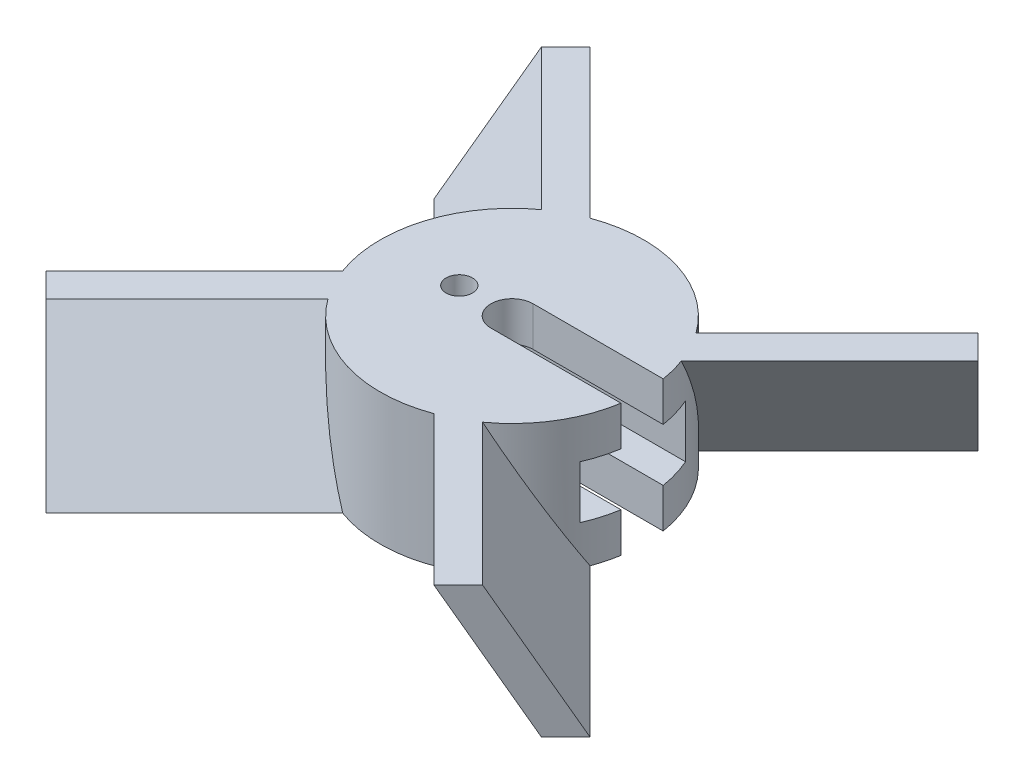
ISO-10303-21;
HEADER;
FILE_DESCRIPTION(('STEP AP214'),'2;1');
FILE_NAME('part.step','',(''),(''),'','','');
FILE_SCHEMA(('AUTOMOTIVE_DESIGN { 1 0 10303 214 1 1 1 1 }'));
ENDSEC;
DATA;
#1=APPLICATION_CONTEXT('core data for automotive mechanical design processes');
#2=APPLICATION_PROTOCOL_DEFINITION('international standard','automotive_design',2000,#1);
#3=PRODUCT_CONTEXT('',#1,'mechanical');
#4=PRODUCT('Part','Part','',(#3));
#5=PRODUCT_RELATED_PRODUCT_CATEGORY('part','',(#4));
#6=PRODUCT_DEFINITION_FORMATION('','',#4);
#7=PRODUCT_DEFINITION_CONTEXT('part definition',#1,'design');
#8=PRODUCT_DEFINITION('design','',#6,#7);
#9=PRODUCT_DEFINITION_SHAPE('','',#8);
#10=(LENGTH_UNIT() NAMED_UNIT(*) SI_UNIT(.MILLI.,.METRE.));
#11=(NAMED_UNIT(*) PLANE_ANGLE_UNIT() SI_UNIT($,.RADIAN.));
#12=(NAMED_UNIT(*) SI_UNIT($,.STERADIAN.) SOLID_ANGLE_UNIT());
#13=UNCERTAINTY_MEASURE_WITH_UNIT(LENGTH_MEASURE(1.E-05),#10,'distance_accuracy_value','');
#14=(GEOMETRIC_REPRESENTATION_CONTEXT(3) GLOBAL_UNCERTAINTY_ASSIGNED_CONTEXT((#13)) GLOBAL_UNIT_ASSIGNED_CONTEXT((#10,
#11,#12)) REPRESENTATION_CONTEXT('',''));
#15=CARTESIAN_POINT('',(0.,0.,0.));
#16=DIRECTION('',(0.,0.,1.));
#17=DIRECTION('',(1.,0.,0.));
#18=AXIS2_PLACEMENT_3D('',#15,#16,#17);
#19=CARTESIAN_POINT('',(0.,10.,0.));
#20=DIRECTION('',(0.,-1.,0.));
#21=DIRECTION('',(0.,0.,-1.));
#22=AXIS2_PLACEMENT_3D('',#19,#20,#21);
#23=CYLINDRICAL_SURFACE('',#22,10.);
#24=CARTESIAN_POINT('',(0.,2.74094045472347,0.));
#25=DIRECTION('',(-0.612372435695799,-0.500000000000006,-0.612372435695786));
#26=DIRECTION('',(0.353553390593282,-0.866025403784435,0.353553390593274));
#27=AXIS2_PLACEMENT_3D('',#24,#25,#26);
#28=ELLIPSE('',#27,19.9999999999998,10.);
#29=CARTESIAN_POINT('',(-9.38359800667765,10.,3.45660070720863));
#30=VERTEX_POINT('',#29);
#31=CARTESIAN_POINT('',(-5.86298353625583,0.,8.10095204612353));
#32=VERTEX_POINT('',#31);
#33=EDGE_CURVE('E56',#30,#32,#28,.F.);
#34=ORIENTED_EDGE('',*,*,#33,.F.);
#35=CARTESIAN_POINT('',(0.,10.,0.));
#36=DIRECTION('',(0.,1.,0.));
#37=DIRECTION('',(0.,0.,1.));
#38=AXIS2_PLACEMENT_3D('',#35,#36,#37);
#39=CIRCLE('',#38,10.);
#40=CARTESIAN_POINT('',(-5.86298353630549,10.,-8.1009520460876));
#41=VERTEX_POINT('',#40);
#42=EDGE_CURVE('E509',#41,#30,#39,.T.);
#43=ORIENTED_EDGE('',*,*,#42,.F.);
#44=CARTESIAN_POINT('',(0.,7.25905954528574,0.));
#45=DIRECTION('',(-0.612372435695792,0.500000000000006,0.612372435695792));
#46=DIRECTION('',(-0.353553390593278,-0.866025403784435,0.353553390593278));
#47=AXIS2_PLACEMENT_3D('',#44,#45,#46);
#48=ELLIPSE('',#47,19.9999999999998,10.);
#49=CARTESIAN_POINT('',(-9.3835980067638,0.,-3.45660070723852));
#50=VERTEX_POINT('',#49);
#51=EDGE_CURVE('E258',#50,#41,#48,.F.);
#52=ORIENTED_EDGE('',*,*,#51,.F.);
#53=CARTESIAN_POINT('',(0.,0.,0.));
#54=DIRECTION('',(0.,1.,0.));
#55=DIRECTION('',(0.,0.,1.));
#56=AXIS2_PLACEMENT_3D('',#53,#54,#55);
#57=CIRCLE('',#56,10.);
#58=EDGE_CURVE('E235',#50,#32,#57,.T.);
#59=ORIENTED_EDGE('',*,*,#58,.T.);
#60=EDGE_LOOP('',(#34,#43,#52,#59));
#61=FACE_BOUND('',#60,.T.);
#62=ADVANCED_FACE('F32',(#61),#23,.T.);
#63=CARTESIAN_POINT('',(0.,7.25905954528574,0.));
#64=DIRECTION('',(0.612372435695799,0.500000000000006,0.612372435695786));
#65=DIRECTION('',(0.353553390593282,-0.866025403784435,0.353553390593274));
#66=AXIS2_PLACEMENT_3D('',#63,#64,#65);
#67=ELLIPSE('',#66,19.9999999999998,10.);
#68=CARTESIAN_POINT('',(-3.45660070706799,0.,9.38359800659327));
#69=VERTEX_POINT('',#68);
#70=CARTESIAN_POINT('',(-8.10095204611743,10.,5.86298353626426));
#71=VERTEX_POINT('',#70);
#72=EDGE_CURVE('E240',#69,#71,#67,.F.);
#73=ORIENTED_EDGE('',*,*,#72,.F.);
#74=CARTESIAN_POINT('',(8.10095204608972,0.,5.86298353630255));
#75=VERTEX_POINT('',#74);
#76=EDGE_CURVE('E224',#69,#75,#57,.T.);
#77=ORIENTED_EDGE('',*,*,#76,.T.);
#78=CARTESIAN_POINT('',(0.,2.74094045472347,0.));
#79=DIRECTION('',(-0.612372435695792,-0.500000000000006,0.612372435695792));
#80=DIRECTION('',(0.353553390593278,-0.866025403784435,-0.353553390593278));
#81=AXIS2_PLACEMENT_3D('',#78,#79,#80);
#82=ELLIPSE('',#81,19.9999999999998,10.);
#83=CARTESIAN_POINT('',(3.45660070720854,10.,9.38359800667769));
#84=VERTEX_POINT('',#83);
#85=EDGE_CURVE('E315',#84,#75,#82,.F.);
#86=ORIENTED_EDGE('',*,*,#85,.F.);
#87=EDGE_CURVE('E48',#71,#84,#39,.T.);
#88=ORIENTED_EDGE('',*,*,#87,.F.);
#89=EDGE_LOOP('',(#73,#77,#86,#88));
#90=FACE_BOUND('',#89,.T.);
#91=ADVANCED_FACE('F241',(#90),#23,.T.);
#92=CARTESIAN_POINT('',(0.,2.74094045472347,0.));
#93=DIRECTION('',(0.612372435695792,-0.500000000000006,-0.612372435695792));
#94=DIRECTION('',(-0.353553390593278,-0.866025403784435,0.353553390593278));
#95=AXIS2_PLACEMENT_3D('',#92,#93,#94);
#96=ELLIPSE('',#95,19.9999999999998,10.);
#97=CARTESIAN_POINT('',(-3.45660070720854,10.,-9.38359800667769));
#98=VERTEX_POINT('',#97);
#99=CARTESIAN_POINT('',(-8.10095204608972,0.,-5.86298353630255));
#100=VERTEX_POINT('',#99);
#101=EDGE_CURVE('E261',#98,#100,#96,.F.);
#102=ORIENTED_EDGE('',*,*,#101,.F.);
#103=CARTESIAN_POINT('',(8.10095204612205,10.,-5.86298353625788));
#104=VERTEX_POINT('',#103);
#105=EDGE_CURVE('E414',#104,#98,#39,.T.);
#106=ORIENTED_EDGE('',*,*,#105,.F.);
#107=CARTESIAN_POINT('',(0.,7.25905954528574,0.));
#108=DIRECTION('',(-0.612372435695794,0.500000000000006,-0.61237243569579));
#109=DIRECTION('',(-0.353553390593279,-0.866025403784435,-0.353553390593277));
#110=AXIS2_PLACEMENT_3D('',#107,#108,#109);
#111=ELLIPSE('',#110,19.9999999999998,10.);
#112=CARTESIAN_POINT('',(3.45660070723852,0.,-9.3835980067638));
#113=VERTEX_POINT('',#112);
#114=EDGE_CURVE('E285',#113,#104,#111,.F.);
#115=ORIENTED_EDGE('',*,*,#114,.F.);
#116=EDGE_CURVE('E417',#113,#100,#57,.T.);
#117=ORIENTED_EDGE('',*,*,#116,.T.);
#118=EDGE_LOOP('',(#102,#106,#115,#117));
#119=FACE_BOUND('',#118,.T.);
#120=ADVANCED_FACE('F508',(#119),#23,.T.);
#121=CARTESIAN_POINT('',(0.,2.74094045472347,0.));
#122=DIRECTION('',(0.612372435695794,-0.500000000000006,0.61237243569579));
#123=DIRECTION('',(-0.353553390593279,-0.866025403784435,-0.353553390593277));
#124=AXIS2_PLACEMENT_3D('',#121,#122,#123);
#125=ELLIPSE('',#124,19.9999999999998,10.);
#126=CARTESIAN_POINT('',(9.38359800667768,10.,-3.45660070720857));
#127=VERTEX_POINT('',#126);
#128=CARTESIAN_POINT('',(5.86298353630252,0.,-8.10095204608974));
#129=VERTEX_POINT('',#128);
#130=EDGE_CURVE('E288',#127,#129,#125,.F.);
#131=ORIENTED_EDGE('',*,*,#130,.F.);
#132=CARTESIAN_POINT('',(9.87117014340245,10.,-1.6));
#133=VERTEX_POINT('',#132);
#134=EDGE_CURVE('E411',#133,#127,#39,.T.);
#135=ORIENTED_EDGE('',*,*,#134,.F.);
#136=DIRECTION('',(0.,-1.,0.));
#137=VECTOR('',#136,1.);
#138=CARTESIAN_POINT('',(9.87117014340245,10.,-1.6));
#139=LINE('',#138,#137);
#140=CARTESIAN_POINT('',(9.87117014340245,7.,-1.6));
#141=VERTEX_POINT('',#140);
#142=EDGE_CURVE('E399',#133,#141,#139,.T.);
#143=ORIENTED_EDGE('',*,*,#142,.T.);
#144=CARTESIAN_POINT('',(0.,7.,0.));
#145=DIRECTION('',(0.,1.,0.));
#146=DIRECTION('',(0.,0.,1.));
#147=AXIS2_PLACEMENT_3D('',#144,#145,#146);
#148=CIRCLE('',#147,10.);
#149=CARTESIAN_POINT('',(9.16515138991168,7.,-4.));
#150=VERTEX_POINT('',#149);
#151=EDGE_CURVE('E361',#141,#150,#148,.T.);
#152=ORIENTED_EDGE('',*,*,#151,.T.);
#153=DIRECTION('',(0.,-1.,0.));
#154=VECTOR('',#153,1.);
#155=CARTESIAN_POINT('',(9.16515138991168,10.,-4.));
#156=LINE('',#155,#154);
#157=CARTESIAN_POINT('',(9.16515138991168,3.,-4.));
#158=VERTEX_POINT('',#157);
#159=EDGE_CURVE('E424',#150,#158,#156,.T.);
#160=ORIENTED_EDGE('',*,*,#159,.T.);
#161=CARTESIAN_POINT('',(0.,3.,0.));
#162=DIRECTION('',(0.,-1.,0.));
#163=DIRECTION('',(0.,0.,-1.));
#164=AXIS2_PLACEMENT_3D('',#161,#162,#163);
#165=CIRCLE('',#164,10.);
#166=CARTESIAN_POINT('',(9.87117014340245,3.,-1.6));
#167=VERTEX_POINT('',#166);
#168=EDGE_CURVE('E348',#158,#167,#165,.T.);
#169=ORIENTED_EDGE('',*,*,#168,.T.);
#170=CARTESIAN_POINT('',(9.87117014340245,0.,-1.6));
#171=VERTEX_POINT('',#170);
#172=EDGE_CURVE('E390',#167,#171,#139,.T.);
#173=ORIENTED_EDGE('',*,*,#172,.T.);
#174=EDGE_CURVE('E238',#171,#129,#57,.T.);
#175=ORIENTED_EDGE('',*,*,#174,.T.);
#176=EDGE_LOOP('',(#131,#135,#143,#152,#160,#169,#173,#175));
#177=FACE_BOUND('',#176,.T.);
#178=ADVANCED_FACE('F478',(#177),#23,.T.);
#179=CARTESIAN_POINT('',(0.,7.25905954528574,0.));
#180=DIRECTION('',(0.612372435695792,0.500000000000006,-0.612372435695792));
#181=DIRECTION('',(0.353553390593278,-0.866025403784435,-0.353553390593278));
#182=AXIS2_PLACEMENT_3D('',#179,#180,#181);
#183=ELLIPSE('',#182,19.9999999999998,10.);
#184=CARTESIAN_POINT('',(9.3835980067638,0.,3.45660070723852));
#185=VERTEX_POINT('',#184);
#186=CARTESIAN_POINT('',(5.86298353627457,10.,8.10095204610997));
#187=VERTEX_POINT('',#186);
#188=EDGE_CURVE('E312',#185,#187,#183,.F.);
#189=ORIENTED_EDGE('',*,*,#188,.F.);
#190=CARTESIAN_POINT('',(9.87117014340245,0.,1.6));
#191=VERTEX_POINT('',#190);
#192=EDGE_CURVE('E236',#185,#191,#57,.T.);
#193=ORIENTED_EDGE('',*,*,#192,.T.);
#194=DIRECTION('',(0.,-1.,0.));
#195=VECTOR('',#194,1.);
#196=CARTESIAN_POINT('',(9.87117014340245,10.,1.6));
#197=LINE('',#196,#195);
#198=CARTESIAN_POINT('',(9.87117014340245,3.,1.6));
#199=VERTEX_POINT('',#198);
#200=EDGE_CURVE('E403',#191,#199,#197,.F.);
#201=ORIENTED_EDGE('',*,*,#200,.T.);
#202=CARTESIAN_POINT('',(9.16515138991168,3.,4.));
#203=VERTEX_POINT('',#202);
#204=EDGE_CURVE('E352',#199,#203,#165,.T.);
#205=ORIENTED_EDGE('',*,*,#204,.T.);
#206=DIRECTION('',(0.,-1.,0.));
#207=VECTOR('',#206,1.);
#208=CARTESIAN_POINT('',(9.16515138991168,10.,4.));
#209=LINE('',#208,#207);
#210=CARTESIAN_POINT('',(9.16515138991168,7.,4.));
#211=VERTEX_POINT('',#210);
#212=EDGE_CURVE('E413',#203,#211,#209,.F.);
#213=ORIENTED_EDGE('',*,*,#212,.T.);
#214=CARTESIAN_POINT('',(9.87117014340245,7.,1.6));
#215=VERTEX_POINT('',#214);
#216=EDGE_CURVE('E366',#211,#215,#148,.T.);
#217=ORIENTED_EDGE('',*,*,#216,.T.);
#218=CARTESIAN_POINT('',(9.87117014340245,10.,1.6));
#219=VERTEX_POINT('',#218);
#220=EDGE_CURVE('E402',#215,#219,#197,.F.);
#221=ORIENTED_EDGE('',*,*,#220,.T.);
#222=EDGE_CURVE('E415',#187,#219,#39,.T.);
#223=ORIENTED_EDGE('',*,*,#222,.F.);
#224=EDGE_LOOP('',(#189,#193,#201,#205,#213,#217,#221,#223));
#225=FACE_BOUND('',#224,.T.);
#226=ADVANCED_FACE('F462',(#225),#23,.T.);
#227=CARTESIAN_POINT('',(0.,0.,0.));
#228=DIRECTION('',(0.,1.,0.));
#229=DIRECTION('',(0.,0.,1.));
#230=AXIS2_PLACEMENT_3D('',#227,#228,#229);
#231=CYLINDRICAL_SURFACE('',#230,1.6);
#232=DIRECTION('',(0.,-1.,0.));
#233=VECTOR('',#232,1.);
#234=CARTESIAN_POINT('',(0.,0.,1.6));
#235=LINE('',#234,#233);
#236=CARTESIAN_POINT('',(0.,10.,1.6));
#237=VERTEX_POINT('',#236);
#238=CARTESIAN_POINT('',(0.,7.,1.6));
#239=VERTEX_POINT('',#238);
#240=EDGE_CURVE('E379',#237,#239,#235,.T.);
#241=ORIENTED_EDGE('',*,*,#240,.T.);
#242=CARTESIAN_POINT('',(0.,7.,0.));
#243=DIRECTION('',(0.,1.,0.));
#244=DIRECTION('',(0.,0.,1.));
#245=AXIS2_PLACEMENT_3D('',#242,#243,#244);
#246=CIRCLE('',#245,1.6);
#247=CARTESIAN_POINT('',(0.,7.,-1.6));
#248=VERTEX_POINT('',#247);
#249=EDGE_CURVE('E365',#239,#248,#246,.F.);
#250=ORIENTED_EDGE('',*,*,#249,.T.);
#251=DIRECTION('',(0.,1.,0.));
#252=VECTOR('',#251,1.);
#253=CARTESIAN_POINT('',(0.,0.,-1.6));
#254=LINE('',#253,#252);
#255=CARTESIAN_POINT('',(0.,10.,-1.6));
#256=VERTEX_POINT('',#255);
#257=EDGE_CURVE('E382',#248,#256,#254,.T.);
#258=ORIENTED_EDGE('',*,*,#257,.T.);
#259=CARTESIAN_POINT('',(0.,10.,0.));
#260=DIRECTION('',(0.,1.,0.));
#261=DIRECTION('',(0.,0.,1.));
#262=AXIS2_PLACEMENT_3D('',#259,#260,#261);
#263=CIRCLE('',#262,1.6);
#264=EDGE_CURVE('E406',#256,#237,#263,.T.);
#265=ORIENTED_EDGE('',*,*,#264,.T.);
#266=EDGE_LOOP('',(#241,#250,#258,#265));
#267=FACE_BOUND('',#266,.T.);
#268=ADVANCED_FACE('F527',(#267),#231,.F.);
#269=CARTESIAN_POINT('',(0.,0.,1.6));
#270=DIRECTION('',(0.,0.,1.));
#271=DIRECTION('',(1.,0.,0.));
#272=AXIS2_PLACEMENT_3D('',#269,#270,#271);
#273=PLANE('',#272);
#274=ORIENTED_EDGE('',*,*,#220,.F.);
#275=DIRECTION('',(-1.,0.,0.));
#276=VECTOR('',#275,1.);
#277=CARTESIAN_POINT('',(0.,7.,1.6));
#278=LINE('',#277,#276);
#279=EDGE_CURVE('E369',#215,#239,#278,.T.);
#280=ORIENTED_EDGE('',*,*,#279,.T.);
#281=ORIENTED_EDGE('',*,*,#240,.F.);
#282=DIRECTION('',(1.,0.,0.));
#283=VECTOR('',#282,1.);
#284=CARTESIAN_POINT('',(0.,10.,1.6));
#285=LINE('',#284,#283);
#286=EDGE_CURVE('E387',#237,#219,#285,.T.);
#287=ORIENTED_EDGE('',*,*,#286,.T.);
#288=EDGE_LOOP('',(#274,#280,#281,#287));
#289=FACE_BOUND('',#288,.T.);
#290=ADVANCED_FACE('F525',(#289),#273,.F.);
#291=CARTESIAN_POINT('',(0.,0.,-1.6));
#292=DIRECTION('',(0.,0.,-1.));
#293=DIRECTION('',(-1.,0.,0.));
#294=AXIS2_PLACEMENT_3D('',#291,#292,#293);
#295=PLANE('',#294);
#296=ORIENTED_EDGE('',*,*,#257,.F.);
#297=DIRECTION('',(1.,0.,0.));
#298=VECTOR('',#297,1.);
#299=CARTESIAN_POINT('',(0.,7.,-1.6));
#300=LINE('',#299,#298);
#301=EDGE_CURVE('E358',#248,#141,#300,.T.);
#302=ORIENTED_EDGE('',*,*,#301,.T.);
#303=ORIENTED_EDGE('',*,*,#142,.F.);
#304=DIRECTION('',(1.,0.,0.));
#305=VECTOR('',#304,1.);
#306=CARTESIAN_POINT('',(0.,10.,-1.6));
#307=LINE('',#306,#305);
#308=EDGE_CURVE('E391',#256,#133,#307,.T.);
#309=ORIENTED_EDGE('',*,*,#308,.F.);
#310=EDGE_LOOP('',(#296,#302,#303,#309));
#311=FACE_BOUND('',#310,.T.);
#312=ADVANCED_FACE('F484',(#311),#295,.F.);
#313=CARTESIAN_POINT('',(-4.,0.,0.));
#314=DIRECTION('',(0.,1.,0.));
#315=DIRECTION('',(0.,0.,1.));
#316=AXIS2_PLACEMENT_3D('',#313,#314,#315);
#317=CYLINDRICAL_SURFACE('',#316,1.);
#318=CARTESIAN_POINT('',(-4.,7.,0.));
#319=DIRECTION('',(0.,1.,0.));
#320=DIRECTION('',(0.,0.,1.));
#321=AXIS2_PLACEMENT_3D('',#318,#319,#320);
#322=CIRCLE('',#321,1.);
#323=CARTESIAN_POINT('',(-4.,7.,1.));
#324=VERTEX_POINT('',#323);
#325=EDGE_CURVE('E362',#324,#324,#322,.F.);
#326=ORIENTED_EDGE('',*,*,#325,.T.);
#327=EDGE_LOOP('',(#326));
#328=FACE_BOUND('',#327,.T.);
#329=CARTESIAN_POINT('',(-4.,10.,0.));
#330=DIRECTION('',(0.,1.,0.));
#331=DIRECTION('',(0.,0.,1.));
#332=AXIS2_PLACEMENT_3D('',#329,#330,#331);
#333=CIRCLE('',#332,1.);
#334=CARTESIAN_POINT('',(-4.,10.,1.));
#335=VERTEX_POINT('',#334);
#336=EDGE_CURVE('E376',#335,#335,#333,.T.);
#337=ORIENTED_EDGE('',*,*,#336,.T.);
#338=EDGE_LOOP('',(#337));
#339=FACE_BOUND('',#338,.T.);
#340=ADVANCED_FACE('F538',(#328,#339),#317,.F.);
#341=CARTESIAN_POINT('',(0.,0.,-1.6));
#342=VERTEX_POINT('',#341);
#343=CARTESIAN_POINT('',(0.,3.,-1.6));
#344=VERTEX_POINT('',#343);
#345=EDGE_CURVE('E383',#342,#344,#254,.T.);
#346=ORIENTED_EDGE('',*,*,#345,.T.);
#347=CARTESIAN_POINT('',(0.,3.,0.));
#348=DIRECTION('',(0.,-1.,0.));
#349=DIRECTION('',(0.,0.,-1.));
#350=AXIS2_PLACEMENT_3D('',#347,#348,#349);
#351=CIRCLE('',#350,1.6);
#352=CARTESIAN_POINT('',(0.,3.,1.6));
#353=VERTEX_POINT('',#352);
#354=EDGE_CURVE('E351',#344,#353,#351,.F.);
#355=ORIENTED_EDGE('',*,*,#354,.T.);
#356=CARTESIAN_POINT('',(0.,0.,1.6));
#357=VERTEX_POINT('',#356);
#358=EDGE_CURVE('E375',#353,#357,#235,.T.);
#359=ORIENTED_EDGE('',*,*,#358,.T.);
#360=CARTESIAN_POINT('',(0.,0.,0.));
#361=DIRECTION('',(0.,1.,0.));
#362=DIRECTION('',(0.,0.,1.));
#363=AXIS2_PLACEMENT_3D('',#360,#361,#362);
#364=CIRCLE('',#363,1.6);
#365=EDGE_CURVE('E407',#342,#357,#364,.T.);
#366=ORIENTED_EDGE('',*,*,#365,.F.);
#367=EDGE_LOOP('',(#346,#355,#359,#366));
#368=FACE_BOUND('',#367,.T.);
#369=ADVANCED_FACE('F470',(#368),#231,.F.);
#370=CARTESIAN_POINT('',(0.,10.,0.));
#371=DIRECTION('',(0.,1.,0.));
#372=DIRECTION('',(0.,0.,1.));
#373=AXIS2_PLACEMENT_3D('',#370,#371,#372);
#374=PLANE('',#373);
#375=ORIENTED_EDGE('',*,*,#336,.F.);
#376=EDGE_LOOP('',(#375));
#377=FACE_BOUND('',#376,.T.);
#378=ORIENTED_EDGE('',*,*,#286,.F.);
#379=ORIENTED_EDGE('',*,*,#264,.F.);
#380=ORIENTED_EDGE('',*,*,#308,.T.);
#381=ORIENTED_EDGE('',*,*,#134,.T.);
#382=DIRECTION('',(-0.707106781186545,0.,0.70710678118655));
#383=VECTOR('',#382,1.);
#384=CARTESIAN_POINT('',(20.6411681794246,9.99999999999999,-14.7141708799028));
#385=LINE('',#384,#383);
#386=CARTESIAN_POINT('',(20.6411681794246,9.99999999999999,-14.7141708799028));
#387=VERTEX_POINT('',#386);
#388=EDGE_CURVE('E309',#387,#127,#385,.T.);
#389=ORIENTED_EDGE('',*,*,#388,.F.);
#390=DIRECTION('',(0.70710678118655,0.,0.707106781186545));
#391=VECTOR('',#390,1.);
#392=CARTESIAN_POINT('',(20.6411681794246,9.99999999999999,-14.7141708799028));
#393=LINE('',#392,#391);
#394=CARTESIAN_POINT('',(18.7966537845414,9.99999999999999,-16.558685274786));
#395=VERTEX_POINT('',#394);
#396=EDGE_CURVE('E291',#395,#387,#393,.T.);
#397=ORIENTED_EDGE('',*,*,#396,.F.);
#398=DIRECTION('',(-0.707106781186545,0.,0.70710678118655));
#399=VECTOR('',#398,1.);
#400=CARTESIAN_POINT('',(18.7966537845414,9.99999999999999,-16.558685274786));
#401=LINE('',#400,#399);
#402=EDGE_CURVE('E300',#395,#104,#401,.T.);
#403=ORIENTED_EDGE('',*,*,#402,.T.);
#404=ORIENTED_EDGE('',*,*,#105,.T.);
#405=DIRECTION('',(0.707106781186547,0.,0.707106781186547));
#406=VECTOR('',#405,1.);
#407=CARTESIAN_POINT('',(-14.7141708799027,9.99999999999999,-20.6411681794246));
#408=LINE('',#407,#406);
#409=CARTESIAN_POINT('',(-14.7141708799027,9.99999999999999,-20.6411681794246));
#410=VERTEX_POINT('',#409);
#411=EDGE_CURVE('E282',#410,#98,#408,.T.);
#412=ORIENTED_EDGE('',*,*,#411,.F.);
#413=DIRECTION('',(0.707106781186548,0.,-0.707106781186548));
#414=VECTOR('',#413,1.);
#415=CARTESIAN_POINT('',(-14.7141708799027,9.99999999999999,-20.6411681794246));
#416=LINE('',#415,#414);
#417=CARTESIAN_POINT('',(-16.558685274786,9.99999999999999,-18.7966537845414));
#418=VERTEX_POINT('',#417);
#419=EDGE_CURVE('E264',#418,#410,#416,.T.);
#420=ORIENTED_EDGE('',*,*,#419,.F.);
#421=DIRECTION('',(0.707106781186547,0.,0.707106781186547));
#422=VECTOR('',#421,1.);
#423=CARTESIAN_POINT('',(-16.558685274786,9.99999999999999,-18.7966537845414));
#424=LINE('',#423,#422);
#425=EDGE_CURVE('E273',#418,#41,#424,.T.);
#426=ORIENTED_EDGE('',*,*,#425,.T.);
#427=ORIENTED_EDGE('',*,*,#42,.T.);
#428=DIRECTION('',(0.70710678118654,0.,-0.707106781186555));
#429=VECTOR('',#428,1.);
#430=CARTESIAN_POINT('',(-20.6411681794245,9.99999999999999,14.714170879903));
#431=LINE('',#430,#429);
#432=CARTESIAN_POINT('',(-20.6411681794245,9.99999999999999,14.714170879903));
#433=VERTEX_POINT('',#432);
#434=EDGE_CURVE('E251',#433,#30,#431,.T.);
#435=ORIENTED_EDGE('',*,*,#434,.F.);
#436=DIRECTION('',(-0.707106781186555,0.,-0.70710678118654));
#437=VECTOR('',#436,1.);
#438=CARTESIAN_POINT('',(-20.6411681794245,9.99999999999999,14.714170879903));
#439=LINE('',#438,#437);
#440=CARTESIAN_POINT('',(-18.7966537845413,9.99999999999999,16.5586852747862));
#441=VERTEX_POINT('',#440);
#442=EDGE_CURVE('E734',#441,#433,#439,.T.);
#443=ORIENTED_EDGE('',*,*,#442,.F.);
#444=DIRECTION('',(0.70710678118654,0.,-0.707106781186555));
#445=VECTOR('',#444,1.);
#446=CARTESIAN_POINT('',(-18.7966537845413,9.99999999999999,16.5586852747862));
#447=LINE('',#446,#445);
#448=EDGE_CURVE('E248',#441,#71,#447,.T.);
#449=ORIENTED_EDGE('',*,*,#448,.T.);
#450=ORIENTED_EDGE('',*,*,#87,.T.);
#451=DIRECTION('',(-0.707106781186547,0.,-0.707106781186547));
#452=VECTOR('',#451,1.);
#453=CARTESIAN_POINT('',(14.7141708799027,9.99999999999999,20.6411681794246));
#454=LINE('',#453,#452);
#455=CARTESIAN_POINT('',(14.7141708799027,9.99999999999999,20.6411681794246));
#456=VERTEX_POINT('',#455);
#457=EDGE_CURVE('E333',#456,#84,#454,.T.);
#458=ORIENTED_EDGE('',*,*,#457,.F.);
#459=DIRECTION('',(-0.707106781186548,0.,0.707106781186548));
#460=VECTOR('',#459,1.);
#461=CARTESIAN_POINT('',(14.7141708799027,9.99999999999999,20.6411681794246));
#462=LINE('',#461,#460);
#463=CARTESIAN_POINT('',(16.558685274786,9.99999999999999,18.7966537845414));
#464=VERTEX_POINT('',#463);
#465=EDGE_CURVE('E317',#464,#456,#462,.T.);
#466=ORIENTED_EDGE('',*,*,#465,.F.);
#467=DIRECTION('',(-0.707106781186547,0.,-0.707106781186547));
#468=VECTOR('',#467,1.);
#469=CARTESIAN_POINT('',(16.558685274786,9.99999999999999,18.7966537845414));
#470=LINE('',#469,#468);
#471=EDGE_CURVE('E326',#464,#187,#470,.T.);
#472=ORIENTED_EDGE('',*,*,#471,.T.);
#473=ORIENTED_EDGE('',*,*,#222,.T.);
#474=EDGE_LOOP('',(#378,#379,#380,#381,#389,#397,#403,#404,#412,#420,#426,#427,#435,#443,#449,
#450,#458,#466,#472,#473));
#475=FACE_BOUND('',#474,.T.);
#476=ADVANCED_FACE('F490',(#377,#475),#374,.T.);
#477=CARTESIAN_POINT('',(0.,0.,0.));
#478=DIRECTION('',(0.,1.,0.));
#479=DIRECTION('',(0.,0.,1.));
#480=AXIS2_PLACEMENT_3D('',#477,#478,#479);
#481=PLANE('',#480);
#482=CARTESIAN_POINT('',(-4.,0.,0.));
#483=DIRECTION('',(0.,1.,0.));
#484=DIRECTION('',(0.,0.,1.));
#485=AXIS2_PLACEMENT_3D('',#482,#483,#484);
#486=CIRCLE('',#485,1.);
#487=CARTESIAN_POINT('',(-4.,0.,1.));
#488=VERTEX_POINT('',#487);
#489=EDGE_CURVE('E372',#488,#488,#486,.T.);
#490=ORIENTED_EDGE('',*,*,#489,.T.);
#491=EDGE_LOOP('',(#490));
#492=FACE_BOUND('',#491,.T.);
#493=ORIENTED_EDGE('',*,*,#365,.T.);
#494=DIRECTION('',(1.,0.,0.));
#495=VECTOR('',#494,1.);
#496=CARTESIAN_POINT('',(0.,0.,1.6));
#497=LINE('',#496,#495);
#498=EDGE_CURVE('E386',#357,#191,#497,.T.);
#499=ORIENTED_EDGE('',*,*,#498,.T.);
#500=ORIENTED_EDGE('',*,*,#192,.F.);
#501=DIRECTION('',(-0.707106781186547,0.,-0.707106781186547));
#502=VECTOR('',#501,1.);
#503=CARTESIAN_POINT('',(20.6411681794246,0.,14.7141708799027));
#504=LINE('',#503,#502);
#505=CARTESIAN_POINT('',(20.6411681794246,0.,14.7141708799027));
#506=VERTEX_POINT('',#505);
#507=EDGE_CURVE('E329',#506,#185,#504,.T.);
#508=ORIENTED_EDGE('',*,*,#507,.F.);
#509=DIRECTION('',(0.707106781186547,0.,-0.707106781186548));
#510=VECTOR('',#509,1.);
#511=CARTESIAN_POINT('',(20.6411681794246,0.,14.7141708799027));
#512=LINE('',#511,#510);
#513=CARTESIAN_POINT('',(18.7966537845414,0.,16.5586852747859));
#514=VERTEX_POINT('',#513);
#515=EDGE_CURVE('E322',#514,#506,#512,.T.);
#516=ORIENTED_EDGE('',*,*,#515,.F.);
#517=DIRECTION('',(-0.707106781186547,0.,-0.707106781186547));
#518=VECTOR('',#517,1.);
#519=CARTESIAN_POINT('',(18.7966537845414,0.,16.5586852747859));
#520=LINE('',#519,#518);
#521=EDGE_CURVE('E233',#514,#75,#520,.T.);
#522=ORIENTED_EDGE('',*,*,#521,.T.);
#523=ORIENTED_EDGE('',*,*,#76,.F.);
#524=DIRECTION('',(0.70710678118654,0.,-0.707106781186555));
#525=VECTOR('',#524,1.);
#526=CARTESIAN_POINT('',(-14.7141708799025,0.,20.6411681794248));
#527=LINE('',#526,#525);
#528=CARTESIAN_POINT('',(-14.7141708799025,0.,20.6411681794248));
#529=VERTEX_POINT('',#528);
#530=EDGE_CURVE('E229',#529,#69,#527,.T.);
#531=ORIENTED_EDGE('',*,*,#530,.F.);
#532=DIRECTION('',(0.707106781186555,0.,0.70710678118654));
#533=VECTOR('',#532,1.);
#534=CARTESIAN_POINT('',(-14.7141708799025,0.,20.6411681794248));
#535=LINE('',#534,#533);
#536=CARTESIAN_POINT('',(-16.5586852747857,0.,18.7966537845416));
#537=VERTEX_POINT('',#536);
#538=EDGE_CURVE('E739',#537,#529,#535,.T.);
#539=ORIENTED_EDGE('',*,*,#538,.F.);
#540=DIRECTION('',(0.70710678118654,0.,-0.707106781186555));
#541=VECTOR('',#540,1.);
#542=CARTESIAN_POINT('',(-16.5586852747857,0.,18.7966537845416));
#543=LINE('',#542,#541);
#544=EDGE_CURVE('E247',#537,#32,#543,.T.);
#545=ORIENTED_EDGE('',*,*,#544,.T.);
#546=ORIENTED_EDGE('',*,*,#58,.F.);
#547=DIRECTION('',(0.707106781186547,0.,0.707106781186547));
#548=VECTOR('',#547,1.);
#549=CARTESIAN_POINT('',(-20.6411681794246,0.,-14.7141708799027));
#550=LINE('',#549,#548);
#551=CARTESIAN_POINT('',(-20.6411681794246,0.,-14.7141708799027));
#552=VERTEX_POINT('',#551);
#553=EDGE_CURVE('E276',#552,#50,#550,.T.);
#554=ORIENTED_EDGE('',*,*,#553,.F.);
#555=DIRECTION('',(-0.707106781186547,0.,0.707106781186548));
#556=VECTOR('',#555,1.);
#557=CARTESIAN_POINT('',(-20.6411681794246,0.,-14.7141708799027));
#558=LINE('',#557,#556);
#559=CARTESIAN_POINT('',(-18.7966537845414,0.,-16.5586852747859));
#560=VERTEX_POINT('',#559);
#561=EDGE_CURVE('E269',#560,#552,#558,.T.);
#562=ORIENTED_EDGE('',*,*,#561,.F.);
#563=DIRECTION('',(0.707106781186547,0.,0.707106781186547));
#564=VECTOR('',#563,1.);
#565=CARTESIAN_POINT('',(-18.7966537845414,0.,-16.5586852747859));
#566=LINE('',#565,#564);
#567=EDGE_CURVE('E279',#560,#100,#566,.T.);
#568=ORIENTED_EDGE('',*,*,#567,.T.);
#569=ORIENTED_EDGE('',*,*,#116,.F.);
#570=DIRECTION('',(-0.707106781186545,0.,0.70710678118655));
#571=VECTOR('',#570,1.);
#572=CARTESIAN_POINT('',(14.7141708799027,0.,-20.6411681794247));
#573=LINE('',#572,#571);
#574=CARTESIAN_POINT('',(14.7141708799027,0.,-20.6411681794247));
#575=VERTEX_POINT('',#574);
#576=EDGE_CURVE('E303',#575,#113,#573,.T.);
#577=ORIENTED_EDGE('',*,*,#576,.F.);
#578=DIRECTION('',(-0.70710678118655,0.,-0.707106781186545));
#579=VECTOR('',#578,1.);
#580=CARTESIAN_POINT('',(14.7141708799027,0.,-20.6411681794247));
#581=LINE('',#580,#579);
#582=CARTESIAN_POINT('',(16.5586852747859,0.,-18.7966537845415));
#583=VERTEX_POINT('',#582);
#584=EDGE_CURVE('E296',#583,#575,#581,.T.);
#585=ORIENTED_EDGE('',*,*,#584,.F.);
#586=DIRECTION('',(-0.707106781186545,0.,0.70710678118655));
#587=VECTOR('',#586,1.);
#588=CARTESIAN_POINT('',(16.5586852747859,0.,-18.7966537845415));
#589=LINE('',#588,#587);
#590=EDGE_CURVE('E306',#583,#129,#589,.T.);
#591=ORIENTED_EDGE('',*,*,#590,.T.);
#592=ORIENTED_EDGE('',*,*,#174,.F.);
#593=DIRECTION('',(1.,0.,0.));
#594=VECTOR('',#593,1.);
#595=CARTESIAN_POINT('',(0.,0.,-1.6));
#596=LINE('',#595,#594);
#597=EDGE_CURVE('E394',#342,#171,#596,.T.);
#598=ORIENTED_EDGE('',*,*,#597,.F.);
#599=EDGE_LOOP('',(#493,#499,#500,#508,#516,#522,#523,#531,#539,#545,#546,#554,#562,#568,#569,
#577,#585,#591,#592,#598));
#600=FACE_BOUND('',#599,.T.);
#601=ADVANCED_FACE('F226',(#492,#600),#481,.F.);
#602=ORIENTED_EDGE('',*,*,#358,.F.);
#603=DIRECTION('',(1.,0.,0.));
#604=VECTOR('',#603,1.);
#605=CARTESIAN_POINT('',(0.,3.,1.6));
#606=LINE('',#605,#604);
#607=EDGE_CURVE('E355',#353,#199,#606,.T.);
#608=ORIENTED_EDGE('',*,*,#607,.T.);
#609=ORIENTED_EDGE('',*,*,#200,.F.);
#610=ORIENTED_EDGE('',*,*,#498,.F.);
#611=EDGE_LOOP('',(#602,#608,#609,#610));
#612=FACE_BOUND('',#611,.T.);
#613=ADVANCED_FACE('F466',(#612),#273,.F.);
#614=ORIENTED_EDGE('',*,*,#172,.F.);
#615=DIRECTION('',(-1.,0.,0.));
#616=VECTOR('',#615,1.);
#617=CARTESIAN_POINT('',(0.,3.,-1.6));
#618=LINE('',#617,#616);
#619=EDGE_CURVE('E345',#167,#344,#618,.T.);
#620=ORIENTED_EDGE('',*,*,#619,.T.);
#621=ORIENTED_EDGE('',*,*,#345,.F.);
#622=ORIENTED_EDGE('',*,*,#597,.T.);
#623=EDGE_LOOP('',(#614,#620,#621,#622));
#624=FACE_BOUND('',#623,.T.);
#625=ADVANCED_FACE('F474',(#624),#295,.F.);
#626=CARTESIAN_POINT('',(-4.,3.,0.));
#627=DIRECTION('',(0.,-1.,0.));
#628=DIRECTION('',(0.,0.,-1.));
#629=AXIS2_PLACEMENT_3D('',#626,#627,#628);
#630=CIRCLE('',#629,1.);
#631=CARTESIAN_POINT('',(-4.,3.,-1.));
#632=VERTEX_POINT('',#631);
#633=EDGE_CURVE('E338',#632,#632,#630,.F.);
#634=ORIENTED_EDGE('',*,*,#633,.T.);
#635=EDGE_LOOP('',(#634));
#636=FACE_BOUND('',#635,.T.);
#637=ORIENTED_EDGE('',*,*,#489,.F.);
#638=EDGE_LOOP('',(#637));
#639=FACE_BOUND('',#638,.T.);
#640=ADVANCED_FACE('F642',(#636,#639),#317,.F.);
#641=CARTESIAN_POINT('',(-7.,3.,4.));
#642=DIRECTION('',(0.,0.,1.));
#643=DIRECTION('',(1.,0.,0.));
#644=AXIS2_PLACEMENT_3D('',#641,#642,#643);
#645=PLANE('',#644);
#646=DIRECTION('',(1.,0.,0.));
#647=VECTOR('',#646,1.);
#648=CARTESIAN_POINT('',(-7.,3.,4.));
#649=LINE('',#648,#647);
#650=CARTESIAN_POINT('',(-3.,3.,4.));
#651=VERTEX_POINT('',#650);
#652=EDGE_CURVE('E343',#651,#203,#649,.T.);
#653=ORIENTED_EDGE('',*,*,#652,.F.);
#654=DIRECTION('',(0.,-1.,0.));
#655=VECTOR('',#654,1.);
#656=CARTESIAN_POINT('',(-3.,3.,4.));
#657=LINE('',#656,#655);
#658=CARTESIAN_POINT('',(-3.,7.,4.));
#659=VERTEX_POINT('',#658);
#660=EDGE_CURVE('E431',#651,#659,#657,.F.);
#661=ORIENTED_EDGE('',*,*,#660,.T.);
#662=DIRECTION('',(1.,0.,0.));
#663=VECTOR('',#662,1.);
#664=CARTESIAN_POINT('',(-7.,7.,4.));
#665=LINE('',#664,#663);
#666=EDGE_CURVE('E336',#659,#211,#665,.T.);
#667=ORIENTED_EDGE('',*,*,#666,.T.);
#668=ORIENTED_EDGE('',*,*,#212,.F.);
#669=EDGE_LOOP('',(#653,#661,#667,#668));
#670=FACE_BOUND('',#669,.T.);
#671=ADVANCED_FACE('F457',(#670),#645,.F.);
#672=CARTESIAN_POINT('',(-7.,3.,-4.));
#673=DIRECTION('',(0.,0.,-1.));
#674=DIRECTION('',(-1.,0.,0.));
#675=AXIS2_PLACEMENT_3D('',#672,#673,#674);
#676=PLANE('',#675);
#677=DIRECTION('',(1.,0.,0.));
#678=VECTOR('',#677,1.);
#679=CARTESIAN_POINT('',(-7.,7.,-4.));
#680=LINE('',#679,#678);
#681=CARTESIAN_POINT('',(-3.,7.,-4.));
#682=VERTEX_POINT('',#681);
#683=EDGE_CURVE('E339',#682,#150,#680,.T.);
#684=ORIENTED_EDGE('',*,*,#683,.F.);
#685=DIRECTION('',(0.,1.,0.));
#686=VECTOR('',#685,1.);
#687=CARTESIAN_POINT('',(-3.,3.,-4.));
#688=LINE('',#687,#686);
#689=CARTESIAN_POINT('',(-3.,3.,-4.));
#690=VERTEX_POINT('',#689);
#691=EDGE_CURVE('E11',#682,#690,#688,.F.);
#692=ORIENTED_EDGE('',*,*,#691,.T.);
#693=DIRECTION('',(1.,0.,0.));
#694=VECTOR('',#693,1.);
#695=CARTESIAN_POINT('',(-7.,3.,-4.));
#696=LINE('',#695,#694);
#697=EDGE_CURVE('E341',#690,#158,#696,.T.);
#698=ORIENTED_EDGE('',*,*,#697,.T.);
#699=ORIENTED_EDGE('',*,*,#159,.F.);
#700=EDGE_LOOP('',(#684,#692,#698,#699));
#701=FACE_BOUND('',#700,.T.);
#702=ADVANCED_FACE('F481',(#701),#676,.F.);
#703=CARTESIAN_POINT('',(-7.,7.,-4.));
#704=DIRECTION('',(0.,1.,0.));
#705=DIRECTION('',(0.,0.,1.));
#706=AXIS2_PLACEMENT_3D('',#703,#704,#705);
#707=PLANE('',#706);
#708=ORIENTED_EDGE('',*,*,#325,.F.);
#709=EDGE_LOOP('',(#708));
#710=FACE_BOUND('',#709,.T.);
#711=ORIENTED_EDGE('',*,*,#666,.F.);
#712=CARTESIAN_POINT('',(-3.,7.,0.));
#713=DIRECTION('',(0.,1.,0.));
#714=DIRECTION('',(0.,0.,1.));
#715=AXIS2_PLACEMENT_3D('',#712,#713,#714);
#716=CIRCLE('',#715,4.);
#717=CARTESIAN_POINT('',(-7.,7.,0.));
#718=VERTEX_POINT('',#717);
#719=EDGE_CURVE('E41',#659,#718,#716,.F.);
#720=ORIENTED_EDGE('',*,*,#719,.T.);
#721=CARTESIAN_POINT('',(-3.,7.,0.));
#722=DIRECTION('',(0.,1.,0.));
#723=DIRECTION('',(0.,0.,1.));
#724=AXIS2_PLACEMENT_3D('',#721,#722,#723);
#725=CIRCLE('',#724,4.);
#726=EDGE_CURVE('E434',#718,#682,#725,.F.);
#727=ORIENTED_EDGE('',*,*,#726,.T.);
#728=ORIENTED_EDGE('',*,*,#683,.T.);
#729=ORIENTED_EDGE('',*,*,#151,.F.);
#730=ORIENTED_EDGE('',*,*,#301,.F.);
#731=ORIENTED_EDGE('',*,*,#249,.F.);
#732=ORIENTED_EDGE('',*,*,#279,.F.);
#733=ORIENTED_EDGE('',*,*,#216,.F.);
#734=EDGE_LOOP('',(#711,#720,#727,#728,#729,#730,#731,#732,#733));
#735=FACE_BOUND('',#734,.T.);
#736=ADVANCED_FACE('F439',(#710,#735),#707,.F.);
#737=CARTESIAN_POINT('',(-7.,3.,-4.));
#738=DIRECTION('',(0.,-1.,0.));
#739=DIRECTION('',(0.,0.,-1.));
#740=AXIS2_PLACEMENT_3D('',#737,#738,#739);
#741=PLANE('',#740);
#742=ORIENTED_EDGE('',*,*,#633,.F.);
#743=EDGE_LOOP('',(#742));
#744=FACE_BOUND('',#743,.T.);
#745=CARTESIAN_POINT('',(-3.,3.,0.));
#746=DIRECTION('',(0.,-1.,0.));
#747=DIRECTION('',(0.,0.,-1.));
#748=AXIS2_PLACEMENT_3D('',#745,#746,#747);
#749=CIRCLE('',#748,4.);
#750=CARTESIAN_POINT('',(-7.,3.,0.));
#751=VERTEX_POINT('',#750);
#752=EDGE_CURVE('E427',#690,#751,#749,.F.);
#753=ORIENTED_EDGE('',*,*,#752,.T.);
#754=CARTESIAN_POINT('',(-3.,3.,0.));
#755=DIRECTION('',(0.,-1.,0.));
#756=DIRECTION('',(0.,0.,-1.));
#757=AXIS2_PLACEMENT_3D('',#754,#755,#756);
#758=CIRCLE('',#757,4.);
#759=EDGE_CURVE('E429',#751,#651,#758,.F.);
#760=ORIENTED_EDGE('',*,*,#759,.T.);
#761=ORIENTED_EDGE('',*,*,#652,.T.);
#762=ORIENTED_EDGE('',*,*,#204,.F.);
#763=ORIENTED_EDGE('',*,*,#607,.F.);
#764=ORIENTED_EDGE('',*,*,#354,.F.);
#765=ORIENTED_EDGE('',*,*,#619,.F.);
#766=ORIENTED_EDGE('',*,*,#168,.F.);
#767=ORIENTED_EDGE('',*,*,#697,.F.);
#768=EDGE_LOOP('',(#753,#760,#761,#762,#763,#764,#765,#766,#767));
#769=FACE_BOUND('',#768,.T.);
#770=ADVANCED_FACE('F453',(#744,#769),#741,.F.);
#771=CARTESIAN_POINT('',(-3.,0.,0.));
#772=DIRECTION('',(0.,1.,0.));
#773=DIRECTION('',(0.,0.,1.));
#774=AXIS2_PLACEMENT_3D('',#771,#772,#773);
#775=CYLINDRICAL_SURFACE('',#774,4.);
#776=ORIENTED_EDGE('',*,*,#691,.F.);
#777=ORIENTED_EDGE('',*,*,#726,.F.);
#778=DIRECTION('',(0.,1.,0.));
#779=VECTOR('',#778,1.);
#780=CARTESIAN_POINT('',(-7.,0.,0.));
#781=LINE('',#780,#779);
#782=EDGE_CURVE('E36',#751,#718,#781,.T.);
#783=ORIENTED_EDGE('',*,*,#782,.F.);
#784=ORIENTED_EDGE('',*,*,#752,.F.);
#785=EDGE_LOOP('',(#776,#777,#783,#784));
#786=FACE_BOUND('',#785,.T.);
#787=ADVANCED_FACE('F34',(#786),#775,.F.);
#788=CARTESIAN_POINT('',(-3.,0.,0.));
#789=DIRECTION('',(0.,-1.,0.));
#790=DIRECTION('',(0.,0.,-1.));
#791=AXIS2_PLACEMENT_3D('',#788,#789,#790);
#792=CYLINDRICAL_SURFACE('',#791,4.);
#793=ORIENTED_EDGE('',*,*,#719,.F.);
#794=ORIENTED_EDGE('',*,*,#660,.F.);
#795=ORIENTED_EDGE('',*,*,#759,.F.);
#796=ORIENTED_EDGE('',*,*,#782,.T.);
#797=EDGE_LOOP('',(#793,#794,#795,#796));
#798=FACE_BOUND('',#797,.T.);
#799=ADVANCED_FACE('F450',(#798),#792,.F.);
#800=CARTESIAN_POINT('',(18.7966537845414,0.,16.5586852747859));
#801=DIRECTION('',(0.612372435695792,0.500000000000006,-0.612372435695792));
#802=DIRECTION('',(-0.707106781186548,0.,-0.707106781186548));
#803=AXIS2_PLACEMENT_3D('',#800,#801,#802);
#804=PLANE('',#803);
#805=ORIENTED_EDGE('',*,*,#457,.T.);
#806=ORIENTED_EDGE('',*,*,#85,.T.);
#807=ORIENTED_EDGE('',*,*,#521,.F.);
#808=DIRECTION('',(0.353553390593278,-0.866025403784435,-0.353553390593278));
#809=VECTOR('',#808,1.);
#810=CARTESIAN_POINT('',(18.7966537845414,0.,16.5586852747859));
#811=LINE('',#810,#809);
#812=EDGE_CURVE('E320',#456,#514,#811,.T.);
#813=ORIENTED_EDGE('',*,*,#812,.F.);
#814=EDGE_LOOP('',(#805,#806,#807,#813));
#815=FACE_BOUND('',#814,.T.);
#816=ADVANCED_FACE('F515',(#815),#804,.F.);
#817=CARTESIAN_POINT('',(20.6411681794246,0.,14.7141708799027));
#818=DIRECTION('',(-0.612372435695792,-0.500000000000006,0.612372435695792));
#819=DIRECTION('',(0.707106781186548,0.,0.707106781186548));
#820=AXIS2_PLACEMENT_3D('',#817,#818,#819);
#821=PLANE('',#820);
#822=ORIENTED_EDGE('',*,*,#507,.T.);
#823=ORIENTED_EDGE('',*,*,#188,.T.);
#824=ORIENTED_EDGE('',*,*,#471,.F.);
#825=DIRECTION('',(-0.353553390593278,0.866025403784435,0.353553390593278));
#826=VECTOR('',#825,1.);
#827=CARTESIAN_POINT('',(20.6411681794246,0.,14.7141708799027));
#828=LINE('',#827,#826);
#829=EDGE_CURVE('E324',#506,#464,#828,.T.);
#830=ORIENTED_EDGE('',*,*,#829,.F.);
#831=EDGE_LOOP('',(#822,#823,#824,#830));
#832=FACE_BOUND('',#831,.T.);
#833=ADVANCED_FACE('F521',(#832),#821,.F.);
#834=CARTESIAN_POINT('',(17.6776695296637,0.,17.6776695296637));
#835=DIRECTION('',(0.707106781186547,0.,0.707106781186547));
#836=DIRECTION('',(0.707106781186548,0.,-0.707106781186548));
#837=AXIS2_PLACEMENT_3D('',#834,#835,#836);
#838=PLANE('',#837);
#839=ORIENTED_EDGE('',*,*,#465,.T.);
#840=ORIENTED_EDGE('',*,*,#812,.T.);
#841=ORIENTED_EDGE('',*,*,#515,.T.);
#842=ORIENTED_EDGE('',*,*,#829,.T.);
#843=EDGE_LOOP('',(#839,#840,#841,#842));
#844=FACE_BOUND('',#843,.T.);
#845=ADVANCED_FACE('F517',(#844),#838,.T.);
#846=CARTESIAN_POINT('',(16.5586852747859,0.,-18.7966537845415));
#847=DIRECTION('',(-0.612372435695794,0.500000000000006,-0.61237243569579));
#848=DIRECTION('',(-0.707106781186545,0.,0.70710678118655));
#849=AXIS2_PLACEMENT_3D('',#846,#847,#848);
#850=PLANE('',#849);
#851=ORIENTED_EDGE('',*,*,#388,.T.);
#852=ORIENTED_EDGE('',*,*,#130,.T.);
#853=ORIENTED_EDGE('',*,*,#590,.F.);
#854=DIRECTION('',(-0.353553390593279,-0.866025403784435,-0.353553390593277));
#855=VECTOR('',#854,1.);
#856=CARTESIAN_POINT('',(16.5586852747859,0.,-18.7966537845415));
#857=LINE('',#856,#855);
#858=EDGE_CURVE('E294',#387,#583,#857,.T.);
#859=ORIENTED_EDGE('',*,*,#858,.F.);
#860=EDGE_LOOP('',(#851,#852,#853,#859));
#861=FACE_BOUND('',#860,.T.);
#862=ADVANCED_FACE('F494',(#861),#850,.F.);
#863=CARTESIAN_POINT('',(14.7141708799027,0.,-20.6411681794247));
#864=DIRECTION('',(0.612372435695794,-0.500000000000006,0.61237243569579));
#865=DIRECTION('',(0.707106781186545,0.,-0.70710678118655));
#866=AXIS2_PLACEMENT_3D('',#863,#864,#865);
#867=PLANE('',#866);
#868=ORIENTED_EDGE('',*,*,#576,.T.);
#869=ORIENTED_EDGE('',*,*,#114,.T.);
#870=ORIENTED_EDGE('',*,*,#402,.F.);
#871=DIRECTION('',(0.353553390593279,0.866025403784435,0.353553390593277));
#872=VECTOR('',#871,1.);
#873=CARTESIAN_POINT('',(14.7141708799027,0.,-20.6411681794247));
#874=LINE('',#873,#872);
#875=EDGE_CURVE('E298',#575,#395,#874,.T.);
#876=ORIENTED_EDGE('',*,*,#875,.F.);
#877=EDGE_LOOP('',(#868,#869,#870,#876));
#878=FACE_BOUND('',#877,.T.);
#879=ADVANCED_FACE('F505',(#878),#867,.F.);
#880=CARTESIAN_POINT('',(17.6776695296636,0.,-17.6776695296637));
#881=DIRECTION('',(0.707106781186545,0.,-0.70710678118655));
#882=DIRECTION('',(-0.70710678118655,0.,-0.707106781186545));
#883=AXIS2_PLACEMENT_3D('',#880,#881,#882);
#884=PLANE('',#883);
#885=ORIENTED_EDGE('',*,*,#396,.T.);
#886=ORIENTED_EDGE('',*,*,#858,.T.);
#887=ORIENTED_EDGE('',*,*,#584,.T.);
#888=ORIENTED_EDGE('',*,*,#875,.T.);
#889=EDGE_LOOP('',(#885,#886,#887,#888));
#890=FACE_BOUND('',#889,.T.);
#891=ADVANCED_FACE('F498',(#890),#884,.T.);
#892=CARTESIAN_POINT('',(-18.7966537845414,0.,-16.5586852747859));
#893=DIRECTION('',(-0.612372435695792,0.500000000000006,0.612372435695792));
#894=DIRECTION('',(0.707106781186548,0.,0.707106781186548));
#895=AXIS2_PLACEMENT_3D('',#892,#893,#894);
#896=PLANE('',#895);
#897=ORIENTED_EDGE('',*,*,#411,.T.);
#898=ORIENTED_EDGE('',*,*,#101,.T.);
#899=ORIENTED_EDGE('',*,*,#567,.F.);
#900=DIRECTION('',(-0.353553390593278,-0.866025403784435,0.353553390593278));
#901=VECTOR('',#900,1.);
#902=CARTESIAN_POINT('',(-18.7966537845414,0.,-16.5586852747859));
#903=LINE('',#902,#901);
#904=EDGE_CURVE('E267',#410,#560,#903,.T.);
#905=ORIENTED_EDGE('',*,*,#904,.F.);
#906=EDGE_LOOP('',(#897,#898,#899,#905));
#907=FACE_BOUND('',#906,.T.);
#908=ADVANCED_FACE('F710',(#907),#896,.F.);
#909=CARTESIAN_POINT('',(-20.6411681794246,0.,-14.7141708799027));
#910=DIRECTION('',(0.612372435695792,-0.500000000000006,-0.612372435695792));
#911=DIRECTION('',(-0.707106781186548,0.,-0.707106781186548));
#912=AXIS2_PLACEMENT_3D('',#909,#910,#911);
#913=PLANE('',#912);
#914=ORIENTED_EDGE('',*,*,#553,.T.);
#915=ORIENTED_EDGE('',*,*,#51,.T.);
#916=ORIENTED_EDGE('',*,*,#425,.F.);
#917=DIRECTION('',(0.353553390593278,0.866025403784435,-0.353553390593278));
#918=VECTOR('',#917,1.);
#919=CARTESIAN_POINT('',(-20.6411681794246,0.,-14.7141708799027));
#920=LINE('',#919,#918);
#921=EDGE_CURVE('E271',#552,#418,#920,.T.);
#922=ORIENTED_EDGE('',*,*,#921,.F.);
#923=EDGE_LOOP('',(#914,#915,#916,#922));
#924=FACE_BOUND('',#923,.T.);
#925=ADVANCED_FACE('F713',(#924),#913,.F.);
#926=CARTESIAN_POINT('',(-17.6776695296637,0.,-17.6776695296637));
#927=DIRECTION('',(-0.707106781186547,0.,-0.707106781186547));
#928=DIRECTION('',(-0.707106781186548,0.,0.707106781186548));
#929=AXIS2_PLACEMENT_3D('',#926,#927,#928);
#930=PLANE('',#929);
#931=ORIENTED_EDGE('',*,*,#419,.T.);
#932=ORIENTED_EDGE('',*,*,#904,.T.);
#933=ORIENTED_EDGE('',*,*,#561,.T.);
#934=ORIENTED_EDGE('',*,*,#921,.T.);
#935=EDGE_LOOP('',(#931,#932,#933,#934));
#936=FACE_BOUND('',#935,.T.);
#937=ADVANCED_FACE('F717',(#936),#930,.T.);
#938=CARTESIAN_POINT('',(-16.5586852747857,0.,18.7966537845416));
#939=DIRECTION('',(0.612372435695799,0.500000000000006,0.612372435695786));
#940=DIRECTION('',(0.70710678118654,0.,-0.707106781186555));
#941=AXIS2_PLACEMENT_3D('',#938,#939,#940);
#942=PLANE('',#941);
#943=ORIENTED_EDGE('',*,*,#434,.T.);
#944=ORIENTED_EDGE('',*,*,#33,.T.);
#945=ORIENTED_EDGE('',*,*,#544,.F.);
#946=DIRECTION('',(0.353553390593282,-0.866025403784435,0.353553390593274));
#947=VECTOR('',#946,1.);
#948=CARTESIAN_POINT('',(-16.5586852747857,0.,18.7966537845416));
#949=LINE('',#948,#947);
#950=EDGE_CURVE('E736',#433,#537,#949,.T.);
#951=ORIENTED_EDGE('',*,*,#950,.F.);
#952=EDGE_LOOP('',(#943,#944,#945,#951));
#953=FACE_BOUND('',#952,.T.);
#954=ADVANCED_FACE('F721',(#953),#942,.F.);
#955=CARTESIAN_POINT('',(-14.7141708799025,0.,20.6411681794248));
#956=DIRECTION('',(-0.612372435695799,-0.500000000000006,-0.612372435695786));
#957=DIRECTION('',(-0.70710678118654,0.,0.707106781186555));
#958=AXIS2_PLACEMENT_3D('',#955,#956,#957);
#959=PLANE('',#958);
#960=ORIENTED_EDGE('',*,*,#530,.T.);
#961=ORIENTED_EDGE('',*,*,#72,.T.);
#962=ORIENTED_EDGE('',*,*,#448,.F.);
#963=DIRECTION('',(-0.353553390593282,0.866025403784435,-0.353553390593274));
#964=VECTOR('',#963,1.);
#965=CARTESIAN_POINT('',(-14.7141708799025,0.,20.6411681794248));
#966=LINE('',#965,#964);
#967=EDGE_CURVE('E246',#529,#441,#966,.T.);
#968=ORIENTED_EDGE('',*,*,#967,.F.);
#969=EDGE_LOOP('',(#960,#961,#962,#968));
#970=FACE_BOUND('',#969,.T.);
#971=ADVANCED_FACE('F245',(#970),#959,.F.);
#972=CARTESIAN_POINT('',(-17.6776695296635,0.,17.6776695296639));
#973=DIRECTION('',(-0.70710678118654,0.,0.707106781186555));
#974=DIRECTION('',(0.707106781186555,0.,0.70710678118654));
#975=AXIS2_PLACEMENT_3D('',#972,#973,#974);
#976=PLANE('',#975);
#977=ORIENTED_EDGE('',*,*,#442,.T.);
#978=ORIENTED_EDGE('',*,*,#950,.T.);
#979=ORIENTED_EDGE('',*,*,#538,.T.);
#980=ORIENTED_EDGE('',*,*,#967,.T.);
#981=EDGE_LOOP('',(#977,#978,#979,#980));
#982=FACE_BOUND('',#981,.T.);
#983=ADVANCED_FACE('F728',(#982),#976,.T.);
#984=CLOSED_SHELL('',(#62,#91,#120,#178,#226,#268,#290,#312,#340,#369,#476,#601,#613,#625,#640,
#671,#702,#736,#770,#787,#799,#816,#833,#845,#862,#879,#891,#908,#925,#937,#954,#971,#983));
#985=MANIFOLD_SOLID_BREP('B2',#984);
#986=ADVANCED_BREP_SHAPE_REPRESENTATION('',(#18,#985),#14);
#987=SHAPE_DEFINITION_REPRESENTATION(#9,#986);
ENDSEC;
END-ISO-10303-21;
